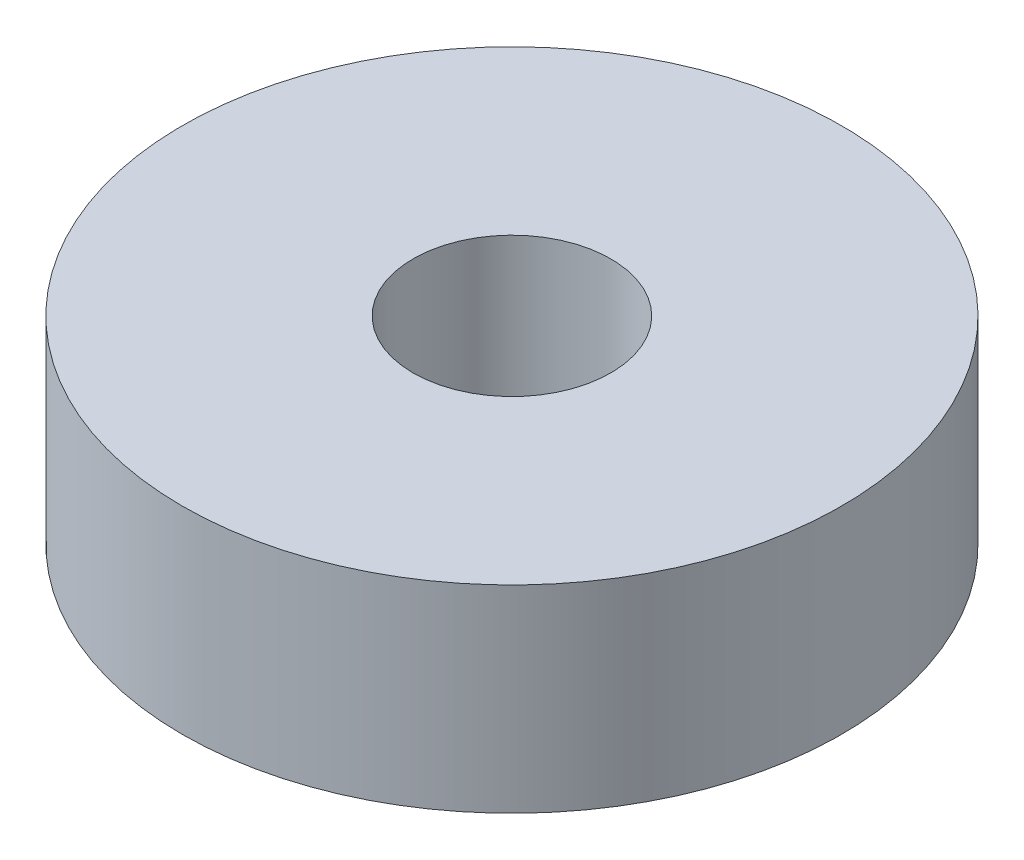
ISO-10303-21;
HEADER;
FILE_DESCRIPTION(('STEP AP214'),'2;1');
FILE_NAME('part.step','',(''),(''),'','','');
FILE_SCHEMA(('AUTOMOTIVE_DESIGN { 1 0 10303 214 1 1 1 1 }'));
ENDSEC;
DATA;
#1=APPLICATION_CONTEXT('core data for automotive mechanical design processes');
#2=APPLICATION_PROTOCOL_DEFINITION('international standard','automotive_design',2000,#1);
#3=PRODUCT_CONTEXT('',#1,'mechanical');
#4=PRODUCT('Part','Part','',(#3));
#5=PRODUCT_RELATED_PRODUCT_CATEGORY('part','',(#4));
#6=PRODUCT_DEFINITION_FORMATION('','',#4);
#7=PRODUCT_DEFINITION_CONTEXT('part definition',#1,'design');
#8=PRODUCT_DEFINITION('design','',#6,#7);
#9=PRODUCT_DEFINITION_SHAPE('','',#8);
#10=(LENGTH_UNIT() NAMED_UNIT(*) SI_UNIT(.MILLI.,.METRE.));
#11=(NAMED_UNIT(*) PLANE_ANGLE_UNIT() SI_UNIT($,.RADIAN.));
#12=(NAMED_UNIT(*) SI_UNIT($,.STERADIAN.) SOLID_ANGLE_UNIT());
#13=UNCERTAINTY_MEASURE_WITH_UNIT(LENGTH_MEASURE(1.E-05),#10,'distance_accuracy_value','');
#14=(GEOMETRIC_REPRESENTATION_CONTEXT(3) GLOBAL_UNCERTAINTY_ASSIGNED_CONTEXT((#13)) GLOBAL_UNIT_ASSIGNED_CONTEXT((#10,
#11,#12)) REPRESENTATION_CONTEXT('',''));
#15=CARTESIAN_POINT('',(0.,0.,0.));
#16=DIRECTION('',(0.,0.,1.));
#17=DIRECTION('',(1.,0.,0.));
#18=AXIS2_PLACEMENT_3D('',#15,#16,#17);
#19=CARTESIAN_POINT('',(0.,6.,0.));
#20=DIRECTION('',(0.,1.,0.));
#21=DIRECTION('',(0.,0.,1.));
#22=AXIS2_PLACEMENT_3D('',#19,#20,#21);
#23=PLANE('',#22);
#24=CARTESIAN_POINT('',(0.,6.,0.));
#25=DIRECTION('',(0.,1.,0.));
#26=DIRECTION('',(0.,0.,1.));
#27=AXIS2_PLACEMENT_3D('',#24,#25,#26);
#28=CIRCLE('',#27,10.);
#29=CARTESIAN_POINT('',(0.,6.,10.));
#30=VERTEX_POINT('',#29);
#31=EDGE_CURVE('E10',#30,#30,#28,.T.);
#32=ORIENTED_EDGE('',*,*,#31,.T.);
#33=EDGE_LOOP('',(#32));
#34=FACE_BOUND('',#33,.T.);
#35=CARTESIAN_POINT('',(0.,6.,0.));
#36=DIRECTION('',(0.,1.,0.));
#37=DIRECTION('',(0.,0.,1.));
#38=AXIS2_PLACEMENT_3D('',#35,#36,#37);
#39=CIRCLE('',#38,3.);
#40=CARTESIAN_POINT('',(0.,6.,3.));
#41=VERTEX_POINT('',#40);
#42=EDGE_CURVE('E50',#41,#41,#39,.T.);
#43=ORIENTED_EDGE('',*,*,#42,.F.);
#44=EDGE_LOOP('',(#43));
#45=FACE_BOUND('',#44,.T.);
#46=ADVANCED_FACE('F37',(#34,#45),#23,.T.);
#47=CARTESIAN_POINT('',(0.,0.,0.));
#48=DIRECTION('',(0.,1.,0.));
#49=DIRECTION('',(0.,0.,1.));
#50=AXIS2_PLACEMENT_3D('',#47,#48,#49);
#51=PLANE('',#50);
#52=CARTESIAN_POINT('',(0.,0.,0.));
#53=DIRECTION('',(0.,1.,0.));
#54=DIRECTION('',(0.,0.,1.));
#55=AXIS2_PLACEMENT_3D('',#52,#53,#54);
#56=CIRCLE('',#55,10.);
#57=CARTESIAN_POINT('',(0.,0.,10.));
#58=VERTEX_POINT('',#57);
#59=EDGE_CURVE('E41',#58,#58,#56,.T.);
#60=ORIENTED_EDGE('',*,*,#59,.F.);
#61=EDGE_LOOP('',(#60));
#62=FACE_BOUND('',#61,.T.);
#63=CARTESIAN_POINT('',(0.,0.,0.));
#64=DIRECTION('',(0.,1.,0.));
#65=DIRECTION('',(0.,0.,1.));
#66=AXIS2_PLACEMENT_3D('',#63,#64,#65);
#67=CIRCLE('',#66,3.);
#68=CARTESIAN_POINT('',(0.,0.,3.));
#69=VERTEX_POINT('',#68);
#70=EDGE_CURVE('E52',#69,#69,#67,.T.);
#71=ORIENTED_EDGE('',*,*,#70,.T.);
#72=EDGE_LOOP('',(#71));
#73=FACE_BOUND('',#72,.T.);
#74=ADVANCED_FACE('F64',(#62,#73),#51,.F.);
#75=CARTESIAN_POINT('',(0.,6.,0.));
#76=DIRECTION('',(0.,-1.,0.));
#77=DIRECTION('',(0.,0.,-1.));
#78=AXIS2_PLACEMENT_3D('',#75,#76,#77);
#79=CYLINDRICAL_SURFACE('',#78,10.);
#80=ORIENTED_EDGE('',*,*,#31,.F.);
#81=EDGE_LOOP('',(#80));
#82=FACE_BOUND('',#81,.T.);
#83=ORIENTED_EDGE('',*,*,#59,.T.);
#84=EDGE_LOOP('',(#83));
#85=FACE_BOUND('',#84,.T.);
#86=ADVANCED_FACE('F39',(#82,#85),#79,.T.);
#87=CARTESIAN_POINT('',(0.,6.,0.));
#88=DIRECTION('',(0.,-1.,0.));
#89=DIRECTION('',(0.,0.,-1.));
#90=AXIS2_PLACEMENT_3D('',#87,#88,#89);
#91=CYLINDRICAL_SURFACE('',#90,3.);
#92=ORIENTED_EDGE('',*,*,#42,.T.);
#93=EDGE_LOOP('',(#92));
#94=FACE_BOUND('',#93,.T.);
#95=ORIENTED_EDGE('',*,*,#70,.F.);
#96=EDGE_LOOP('',(#95));
#97=FACE_BOUND('',#96,.T.);
#98=ADVANCED_FACE('F60',(#94,#97),#91,.F.);
#99=CLOSED_SHELL('',(#46,#74,#86,#98));
#100=MANIFOLD_SOLID_BREP('B2',#99);
#101=ADVANCED_BREP_SHAPE_REPRESENTATION('',(#18,#100),#14);
#102=SHAPE_DEFINITION_REPRESENTATION(#9,#101);
ENDSEC;
END-ISO-10303-21;
